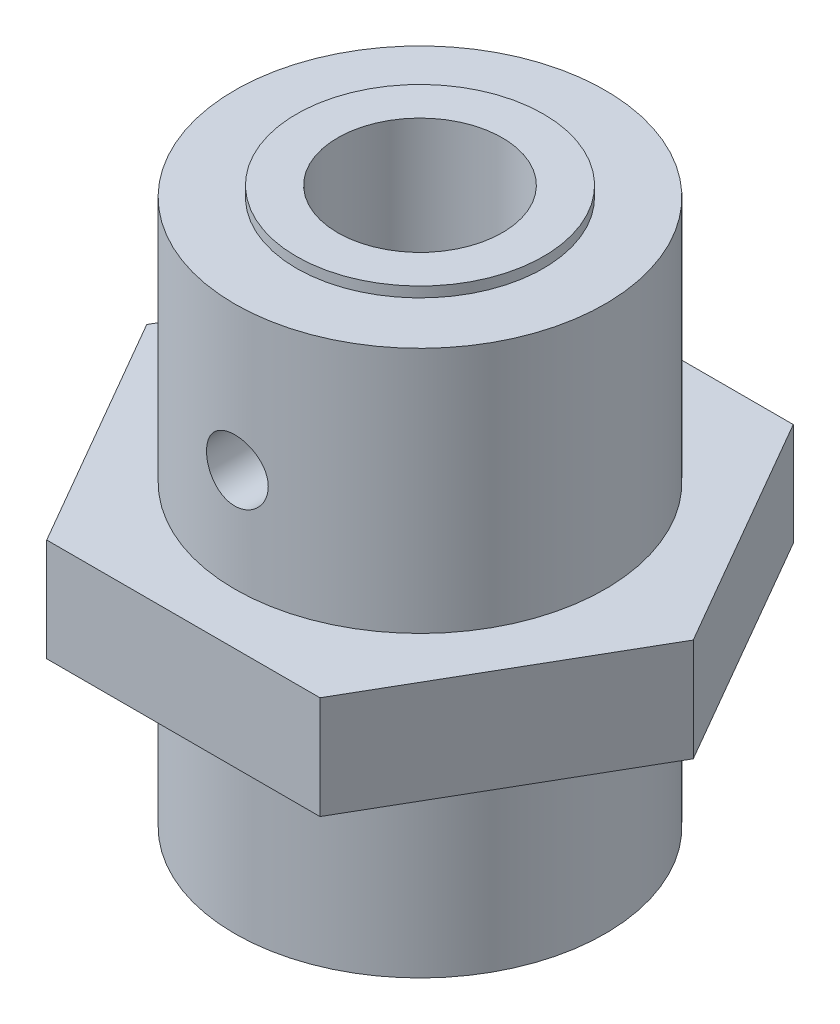
ISO-10303-21;
HEADER;
FILE_DESCRIPTION(('STEP AP214'),'2;1');
FILE_NAME('part.step','',(''),(''),'','','');
FILE_SCHEMA(('AUTOMOTIVE_DESIGN { 1 0 10303 214 1 1 1 1 }'));
ENDSEC;
DATA;
#1=APPLICATION_CONTEXT('core data for automotive mechanical design processes');
#2=APPLICATION_PROTOCOL_DEFINITION('international standard','automotive_design',2000,#1);
#3=PRODUCT_CONTEXT('',#1,'mechanical');
#4=PRODUCT('Part','Part','',(#3));
#5=PRODUCT_RELATED_PRODUCT_CATEGORY('part','',(#4));
#6=PRODUCT_DEFINITION_FORMATION('','',#4);
#7=PRODUCT_DEFINITION_CONTEXT('part definition',#1,'design');
#8=PRODUCT_DEFINITION('design','',#6,#7);
#9=PRODUCT_DEFINITION_SHAPE('','',#8);
#10=(LENGTH_UNIT() NAMED_UNIT(*) SI_UNIT(.MILLI.,.METRE.));
#11=(NAMED_UNIT(*) PLANE_ANGLE_UNIT() SI_UNIT($,.RADIAN.));
#12=(NAMED_UNIT(*) SI_UNIT($,.STERADIAN.) SOLID_ANGLE_UNIT());
#13=UNCERTAINTY_MEASURE_WITH_UNIT(LENGTH_MEASURE(1.E-05),#10,'distance_accuracy_value','');
#14=(GEOMETRIC_REPRESENTATION_CONTEXT(3) GLOBAL_UNCERTAINTY_ASSIGNED_CONTEXT((#13)) GLOBAL_UNIT_ASSIGNED_CONTEXT((#10,
#11,#12)) REPRESENTATION_CONTEXT('',''));
#15=CARTESIAN_POINT('',(0.,0.,0.));
#16=DIRECTION('',(0.,0.,1.));
#17=DIRECTION('',(1.,0.,0.));
#18=AXIS2_PLACEMENT_3D('',#15,#16,#17);
#19=CARTESIAN_POINT('',(0.,27.,0.));
#20=DIRECTION('',(0.,-1.,0.));
#21=DIRECTION('',(0.,0.,-1.));
#22=AXIS2_PLACEMENT_3D('',#19,#20,#21);
#23=CYLINDRICAL_SURFACE('',#22,9.);
#24=CARTESIAN_POINT('',(0.,0.,0.));
#25=DIRECTION('',(0.,1.,0.));
#26=DIRECTION('',(0.,0.,1.));
#27=AXIS2_PLACEMENT_3D('',#24,#25,#26);
#28=CIRCLE('',#27,9.);
#29=CARTESIAN_POINT('',(0.,0.,9.));
#30=VERTEX_POINT('',#29);
#31=EDGE_CURVE('E48',#30,#30,#28,.T.);
#32=ORIENTED_EDGE('',*,*,#31,.T.);
#33=EDGE_LOOP('',(#32));
#34=FACE_BOUND('',#33,.T.);
#35=CARTESIAN_POINT('',(0.,9.5,0.));
#36=DIRECTION('',(0.,1.,0.));
#37=DIRECTION('',(0.,0.,1.));
#38=AXIS2_PLACEMENT_3D('',#35,#36,#37);
#39=CIRCLE('',#38,9.);
#40=CARTESIAN_POINT('',(0.,9.5,9.));
#41=VERTEX_POINT('',#40);
#42=EDGE_CURVE('E11',#41,#41,#39,.T.);
#43=ORIENTED_EDGE('',*,*,#42,.F.);
#44=EDGE_LOOP('',(#43));
#45=FACE_BOUND('',#44,.T.);
#46=ADVANCED_FACE('F32',(#34,#45),#23,.T.);
#47=CARTESIAN_POINT('',(0.,27.,0.));
#48=DIRECTION('',(0.,1.,0.));
#49=DIRECTION('',(0.,0.,1.));
#50=AXIS2_PLACEMENT_3D('',#47,#48,#49);
#51=PLANE('',#50);
#52=CARTESIAN_POINT('',(0.,27.,0.));
#53=DIRECTION('',(0.,1.,0.));
#54=DIRECTION('',(0.,0.,1.));
#55=AXIS2_PLACEMENT_3D('',#52,#53,#54);
#56=CIRCLE('',#55,4.);
#57=CARTESIAN_POINT('',(0.,27.,4.));
#58=VERTEX_POINT('',#57);
#59=EDGE_CURVE('E350',#58,#58,#56,.T.);
#60=ORIENTED_EDGE('',*,*,#59,.F.);
#61=EDGE_LOOP('',(#60));
#62=FACE_BOUND('',#61,.T.);
#63=CARTESIAN_POINT('',(0.,27.,0.));
#64=DIRECTION('',(0.,1.,0.));
#65=DIRECTION('',(0.,0.,1.));
#66=AXIS2_PLACEMENT_3D('',#63,#64,#65);
#67=CIRCLE('',#66,6.);
#68=CARTESIAN_POINT('',(0.,27.,6.));
#69=VERTEX_POINT('',#68);
#70=EDGE_CURVE('E351',#69,#69,#67,.T.);
#71=ORIENTED_EDGE('',*,*,#70,.T.);
#72=EDGE_LOOP('',(#71));
#73=FACE_BOUND('',#72,.T.);
#74=ADVANCED_FACE('F193',(#62,#73),#51,.T.);
#75=CARTESIAN_POINT('',(0.,14.5,0.));
#76=DIRECTION('',(0.,1.,0.));
#77=DIRECTION('',(0.,0.,1.));
#78=AXIS2_PLACEMENT_3D('',#75,#76,#77);
#79=CIRCLE('',#78,9.);
#80=CARTESIAN_POINT('',(0.,14.5,9.));
#81=VERTEX_POINT('',#80);
#82=EDGE_CURVE('E146',#81,#81,#79,.T.);
#83=ORIENTED_EDGE('',*,*,#82,.T.);
#84=EDGE_LOOP('',(#83));
#85=FACE_BOUND('',#84,.T.);
#86=CARTESIAN_POINT('',(0.,21.,-9.));
#87=CARTESIAN_POINT('',(-0.0836345429749289,20.9999966466313,-8.99999856701294));
#88=CARTESIAN_POINT('',(-0.167314729103292,20.9929816350186,-8.9988220674782));
#89=CARTESIAN_POINT('',(-0.332328133003825,20.9651186047408,-8.99424206964832));
#90=CARTESIAN_POINT('',(-0.413659120775548,20.944257865853,-8.99083652354334));
#91=CARTESIAN_POINT('',(-0.571562848327586,20.8893507308443,-8.9821804094187));
#92=CARTESIAN_POINT('',(-0.64813942105914,20.8553151206157,-8.97693135095516));
#93=CARTESIAN_POINT('',(-0.794485105186766,20.7750526247686,-8.96516536249242));
#94=CARTESIAN_POINT('',(-0.864254993927155,20.7288271335102,-8.9586485775266));
#95=CARTESIAN_POINT('',(-0.995683568575008,20.6250269497077,-8.94499990474988));
#96=CARTESIAN_POINT('',(-1.05726774212098,20.5673585312183,-8.93786323088914));
#97=CARTESIAN_POINT('',(-1.16993309919596,20.4425112189163,-8.92381576126039));
#98=CARTESIAN_POINT('',(-1.22101361963458,20.375331725126,-8.91690497977601));
#99=CARTESIAN_POINT('',(-1.31152027536308,20.2328574202818,-8.90404539455869));
#100=CARTESIAN_POINT('',(-1.3508727317166,20.1575151979171,-8.89810277454982));
#101=CARTESIAN_POINT('',(-1.41633501924673,20.0011742614196,-8.88791873876805));
#102=CARTESIAN_POINT('',(-1.44244574493937,19.9201759297934,-8.88367720808584));
#103=CARTESIAN_POINT('',(-1.48044862667089,19.7556118350861,-8.87742322105653));
#104=CARTESIAN_POINT('',(-1.49246941748124,19.6720765580992,-8.8753906109142));
#105=CARTESIAN_POINT('',(-1.50235003517393,19.5041518338699,-8.8737236336199));
#106=CARTESIAN_POINT('',(-1.5002108642334,19.4197624474996,-8.87408909674329));
#107=CARTESIAN_POINT('',(-1.48193705903769,19.2534432832347,-8.87715857318133));
#108=CARTESIAN_POINT('',(-1.46594692913386,19.1714971178729,-8.8798384399135));
#109=CARTESIAN_POINT('',(-1.42065188424207,19.0114672093025,-8.88719697126605));
#110=CARTESIAN_POINT('',(-1.39134651259184,18.9333835986669,-8.89187570443963));
#111=CARTESIAN_POINT('',(-1.32010634765635,18.7828627059354,-8.9027308760046));
#112=CARTESIAN_POINT('',(-1.27811154832783,18.7104543563513,-8.90891440264395));
#113=CARTESIAN_POINT('',(-1.18272721053446,18.573657359677,-8.92207751049005));
#114=CARTESIAN_POINT('',(-1.12933675239257,18.509269360527,-8.92905715592572));
#115=CARTESIAN_POINT('',(-1.01188932729543,18.3895043485156,-8.94313216727871));
#116=CARTESIAN_POINT('',(-0.947708378323878,18.334248888876,-8.95022789538991));
#117=CARTESIAN_POINT('',(-0.810921149388988,18.2352733424008,-8.96365560838034));
#118=CARTESIAN_POINT('',(-0.738314815143853,18.1915533298901,-8.96998758833847));
#119=CARTESIAN_POINT('',(-0.586623549700025,18.1168786637182,-8.98118335735747));
#120=CARTESIAN_POINT('',(-0.507533235338796,18.0859347484012,-8.98604591044468));
#121=CARTESIAN_POINT('',(-0.345179007361639,18.0378034708524,-8.99374501807596));
#122=CARTESIAN_POINT('',(-0.261915443507681,18.0206149578158,-8.99658174210284));
#123=CARTESIAN_POINT('',(-0.0946259407809746,18.0006471849233,-8.99988677905612));
#124=CARTESIAN_POINT('',(-0.0106204422906071,17.9977010569166,-9.00038251807671));
#125=CARTESIAN_POINT('',(0.156683863733932,18.0058568066569,-8.99902484652702));
#126=CARTESIAN_POINT('',(0.239982698335223,18.0169581438802,-8.99717152634471));
#127=CARTESIAN_POINT('',(0.402993705328058,18.0527549096013,-8.99134096162921));
#128=CARTESIAN_POINT('',(0.482724521031228,18.0773677250341,-8.98737662880787));
#129=CARTESIAN_POINT('',(0.636928130916265,18.1394007109197,-8.97776678673215));
#130=CARTESIAN_POINT('',(0.711400629545831,18.1768216005812,-8.97212118307212));
#131=CARTESIAN_POINT('',(0.853698413681374,18.2637906748181,-8.95970709781445));
#132=CARTESIAN_POINT('',(0.921459150562287,18.3134430937003,-8.95292913532213));
#133=CARTESIAN_POINT('',(1.04774615130161,18.423322389231,-8.93903080435141));
#134=CARTESIAN_POINT('',(1.10627174381795,18.483550033966,-8.93191041102928));
#135=CARTESIAN_POINT('',(1.2130456677948,18.6136185288429,-8.91804105141507));
#136=CARTESIAN_POINT('',(1.26118125666823,18.6835524993086,-8.91129669682264));
#137=CARTESIAN_POINT('',(1.34502138617699,18.8306117814831,-8.89902917866731));
#138=CARTESIAN_POINT('',(1.38072632086189,18.9077368651365,-8.89350597639612));
#139=CARTESIAN_POINT('',(1.43852299888389,19.0666738396873,-8.88434072218623));
#140=CARTESIAN_POINT('',(1.46067085952877,19.1484648570183,-8.88069092586639));
#141=CARTESIAN_POINT('',(1.49090127226697,19.3146720775331,-8.87566630101156));
#142=CARTESIAN_POINT('',(1.4989850471677,19.3990880518392,-8.87429127469633));
#143=CARTESIAN_POINT('',(1.50082371962841,19.5670230995774,-8.87398039850407));
#144=CARTESIAN_POINT('',(1.49475608167511,19.6505402271452,-8.8750143390339));
#145=CARTESIAN_POINT('',(1.46884790337411,19.8153475488305,-8.87933868872237));
#146=CARTESIAN_POINT('',(1.44900740766749,19.8966377501651,-8.88262909056728));
#147=CARTESIAN_POINT('',(1.39618469375694,20.0546150623756,-8.89108413769032));
#148=CARTESIAN_POINT('',(1.36321775436027,20.1313074060336,-8.89624660331802));
#149=CARTESIAN_POINT('',(1.28509620234955,20.2781014015169,-8.90786621353324));
#150=CARTESIAN_POINT('',(1.23994098524914,20.3482027262233,-8.91432342233039));
#151=CARTESIAN_POINT('',(1.13809133062329,20.4807213498647,-8.92790072427373));
#152=CARTESIAN_POINT('',(1.08126633815619,20.5430376100202,-8.93502777345782));
#153=CARTESIAN_POINT('',(0.957965418828139,20.657310962685,-8.94908623416505));
#154=CARTESIAN_POINT('',(0.891487267747583,20.7092656611829,-8.95601760015928));
#155=CARTESIAN_POINT('',(0.75022150178417,20.80166896092,-8.96895917785332));
#156=CARTESIAN_POINT('',(0.675379672519693,20.8420356235878,-8.97496269751863));
#157=CARTESIAN_POINT('',(0.519907841627391,20.909561690766,-8.98530700561065));
#158=CARTESIAN_POINT('',(0.439283696898008,20.9367342486478,-8.98964944906489));
#159=CARTESIAN_POINT('',(0.298621986027242,20.971203164476,-8.99523474499773));
#160=CARTESIAN_POINT('',(0.239435298179069,20.9819846817696,-8.99701216364015));
#161=CARTESIAN_POINT('',(0.120173586191886,20.9963842427069,-8.99939529591673));
#162=CARTESIAN_POINT('',(0.0600985773650965,21.0000024096824,-9.00000102972385));
#163=CARTESIAN_POINT('',(0.,21.,-9.));
#164=B_SPLINE_CURVE_WITH_KNOTS('',3,(#86,#87,#88,#89,#90,#91,#92,#93,#94,#95,#96,#97,#98,#99,
#100,#101,#102,#103,#104,#105,#106,#107,#108,#109,#110,#111,#112,#113,#114,#115,#116,#117,#118,
#119,#120,#121,#122,#123,#124,#125,#126,#127,#128,#129,#130,#131,#132,#133,#134,#135,#136,#137,
#138,#139,#140,#141,#142,#143,#144,#145,#146,#147,#148,#149,#150,#151,#152,#153,#154,#155,#156,
#157,#158,#159,#160,#161,#162,#163),.UNSPECIFIED.,.T.,.F.,(4,2,2,2,2,2,2,2,2,2,2,2,2,2,2,2,2,2,
2,2,2,2,2,2,2,2,2,2,2,2,2,2,2,2,2,2,2,2,4),(0.,0.250683950963106,0.501598527417252,
0.752308120215161,1.00298904760487,1.25581494637399,1.50865680101914,1.76305512494304,
2.01743626125709,2.26947646262054,2.52149882592532,2.77092313056246,3.02035599015229,
3.27098733979535,3.52163892408344,3.77539661946796,4.02915594981509,4.28312813349542,
4.53707906712689,4.78804730094839,5.03900587821516,5.2884468420385,5.5379018149564,
5.78956095376214,6.0412383783257,6.29552293204572,6.54979942425566,6.80301613405064,
7.05621082671971,7.30624745713621,7.55628327712881,7.80602890935734,8.05578693017602,
8.30850830516036,8.56128800327384,8.8158133896432,9.07008451278043,9.25022548898411,
9.43036336366181),.UNSPECIFIED.);
#165=CARTESIAN_POINT('',(0.,21.,-9.));
#166=VERTEX_POINT('',#165);
#167=EDGE_CURVE('E161',#166,#166,#164,.T.);
#168=ORIENTED_EDGE('',*,*,#167,.T.);
#169=EDGE_LOOP('',(#168));
#170=FACE_BOUND('',#169,.T.);
#171=CARTESIAN_POINT('',(1.5,19.5,8.87411967464942));
#172=CARTESIAN_POINT('',(1.4999966390526,19.4163745511124,8.87412118440766));
#173=CARTESIAN_POINT('',(1.49298310142239,19.3327034363851,8.8753145552884));
#174=CARTESIAN_POINT('',(1.46512645684524,19.1677088740679,8.87995474420907));
#175=CARTESIAN_POINT('',(1.44427059618579,19.0863876637503,8.88340364034856));
#176=CARTESIAN_POINT('',(1.38937772620029,18.9285046299859,8.89215365593394));
#177=CARTESIAN_POINT('',(1.35535173295865,18.8519388908002,8.8974532270317));
#178=CARTESIAN_POINT('',(1.27511189813422,18.7056114271718,8.90930563268603));
#179=CARTESIAN_POINT('',(1.22889942810094,18.6358489382543,8.91585832618484));
#180=CARTESIAN_POINT('',(1.12511251617978,18.5044122901526,8.92955082691565));
#181=CARTESIAN_POINT('',(1.06744142935937,18.4428149211681,8.93669530396241));
#182=CARTESIAN_POINT('',(0.942583202817205,18.3301240158831,8.95072488401675));
#183=CARTESIAN_POINT('',(0.875395499489994,18.2790311021308,8.95760997163183));
#184=CARTESIAN_POINT('',(0.732913721969003,18.1885112596684,8.97039442189482));
#185=CARTESIAN_POINT('',(0.657573648874023,18.1491557953609,8.97628765459366));
#186=CARTESIAN_POINT('',(0.501237373034324,18.0836873576817,8.98637242174293));
#187=CARTESIAN_POINT('',(0.420241538446913,18.0575735232691,8.99056406683605));
#188=CARTESIAN_POINT('',(0.255686235806544,18.0195644790097,8.99674040834628));
#189=CARTESIAN_POINT('',(0.172157332007562,18.0075402503972,8.99874511866543));
#190=CARTESIAN_POINT('',(0.00424517131547819,17.9976505475084,9.00039047605669));
#191=CARTESIAN_POINT('',(-0.0801380271173394,17.9997841108517,9.00003128381585));
#192=CARTESIAN_POINT('',(-0.246481311047326,18.0180488109169,8.99700515058833));
#193=CARTESIAN_POINT('',(-0.328457118420085,18.0340410980455,8.99436110215438));
#194=CARTESIAN_POINT('',(-0.488545187767075,18.0793506445479,8.98708787262982));
#195=CARTESIAN_POINT('',(-0.566657331990903,18.1086683097537,8.98245863107927));
#196=CARTESIAN_POINT('',(-0.71721368866959,18.1799343841892,8.97169619107175));
#197=CARTESIAN_POINT('',(-0.789630313811427,18.2219400072495,8.96555620396128));
#198=CARTESIAN_POINT('',(-0.926439317907985,18.317347693581,8.95245442842898));
#199=CARTESIAN_POINT('',(-0.990831046749526,18.3707506792265,8.94549257351481));
#200=CARTESIAN_POINT('',(-1.110582764068,18.4882072839716,8.93142160939558));
#201=CARTESIAN_POINT('',(-1.16582370135193,18.5523822569406,8.92431173838625));
#202=CARTESIAN_POINT('',(-1.26477275306884,18.6891522541295,8.91082775870884));
#203=CARTESIAN_POINT('',(-1.30848076111945,18.7617473560097,8.90445365682795));
#204=CARTESIAN_POINT('',(-1.38314666069297,18.9134349851265,8.8931625273709));
#205=CARTESIAN_POINT('',(-1.41409021636755,18.9925346988553,8.88824713981561));
#206=CARTESIAN_POINT('',(-1.46221792248937,19.1549094433845,8.88045713213928));
#207=CARTESIAN_POINT('',(-1.47940328446077,19.2381841058595,8.87758233232993));
#208=CARTESIAN_POINT('',(-1.49935913092756,19.4054796936973,8.8742337565327));
#209=CARTESIAN_POINT('',(-1.50229932474746,19.4894798278213,8.87373171455201));
#210=CARTESIAN_POINT('',(-1.49413362160948,19.6567720030145,8.87511020869417));
#211=CARTESIAN_POINT('',(-1.4830282671748,19.7400640713084,8.87699065279112));
#212=CARTESIAN_POINT('',(-1.44723140095686,19.9030366555145,8.88289612473011));
#213=CARTESIAN_POINT('',(-1.42262627438783,19.9827366839268,8.88690751151009));
#214=CARTESIAN_POINT('',(-1.36061891411537,20.1368820997677,8.89661143803301));
#215=CARTESIAN_POINT('',(-1.32321591486056,20.2113271725305,8.90230407834347));
#216=CARTESIAN_POINT('',(-1.23627400393754,20.3536047566437,8.91479477038436));
#217=CARTESIAN_POINT('',(-1.18662633849562,20.4213699436536,8.92160253360208));
#218=CARTESIAN_POINT('',(-1.07675367942479,20.547668119617,8.9355280000792));
#219=CARTESIAN_POINT('',(-1.01652794183043,20.6062004586658,8.94264572511199));
#220=CARTESIAN_POINT('',(-0.886456842197286,20.7129911356372,8.95647853270959));
#221=CARTESIAN_POINT('',(-0.816517952031718,20.7611362957707,8.96318865806804));
#222=CARTESIAN_POINT('',(-0.669446068769596,20.8449931962029,8.97537067459765));
#223=CARTESIAN_POINT('',(-0.592313308482377,20.8807053386843,8.98084260581986));
#224=CARTESIAN_POINT('',(-0.433379430900797,20.9385063503729,8.9899101490175));
#225=CARTESIAN_POINT('',(-0.351600337561567,20.960654445441,8.99351390740573));
#226=CARTESIAN_POINT('',(-0.185418440924528,20.9908893593783,8.99847349901569));
#227=CARTESIAN_POINT('',(-0.101015854092975,20.9989773352394,8.99982951720106));
#228=CARTESIAN_POINT('',(0.0669247654642075,21.0008291293873,9.00013822732695));
#229=CARTESIAN_POINT('',(0.150460896361607,20.9947651523646,8.99911981214544));
#230=CARTESIAN_POINT('',(0.315307184588814,20.9688576466384,8.9948530703237));
#231=CARTESIAN_POINT('',(0.396617354380455,20.9490141950943,8.99160475617001));
#232=CARTESIAN_POINT('',(0.554637867551155,20.8961771006737,8.98324193296551));
#233=CARTESIAN_POINT('',(0.631353223292413,20.8631980990737,8.97812950224933));
#234=CARTESIAN_POINT('',(0.778188271789178,20.7850452382619,8.96659654126411));
#235=CARTESIAN_POINT('',(0.848307651670479,20.7398708009634,8.96017594898929));
#236=CARTESIAN_POINT('',(0.980827767316295,20.6379989445228,8.94664577771383));
#237=CARTESIAN_POINT('',(1.04313085836337,20.5811754271459,8.9395291473044));
#238=CARTESIAN_POINT('',(1.15737832556883,20.4578830152611,8.92545781982852));
#239=CARTESIAN_POINT('',(1.20932027202072,20.3914118646651,8.91850316108162));
#240=CARTESIAN_POINT('',(1.30170856255177,20.2501528064954,8.90549006142059));
#241=CARTESIAN_POINT('',(1.34207099345672,20.1753093960972,8.89943830788741));
#242=CARTESIAN_POINT('',(1.40958872186455,20.0198344584531,8.88899526133062));
#243=CARTESIAN_POINT('',(1.43675721313896,19.9392088063819,8.88460231050764));
#244=CARTESIAN_POINT('',(1.47121563187329,19.798557738314,8.87894846902668));
#245=CARTESIAN_POINT('',(1.48199245060217,19.7393839152249,8.8771477405261));
#246=CARTESIAN_POINT('',(1.49638577710945,19.6201479090953,8.87473281171912));
#247=CARTESIAN_POINT('',(1.50000241487516,19.5600857422019,8.87411858987266));
#248=CARTESIAN_POINT('',(1.5,19.5,8.87411967464942));
#249=B_SPLINE_CURVE_WITH_KNOTS('',3,(#171,#172,#173,#174,#175,#176,#177,#178,#179,#180,#181,
#182,#183,#184,#185,#186,#187,#188,#189,#190,#191,#192,#193,#194,#195,#196,#197,#198,#199,#200,
#201,#202,#203,#204,#205,#206,#207,#208,#209,#210,#211,#212,#213,#214,#215,#216,#217,#218,#219,
#220,#221,#222,#223,#224,#225,#226,#227,#228,#229,#230,#231,#232,#233,#234,#235,#236,#237,#238,
#239,#240,#241,#242,#243,#244,#245,#246,#247,#248),.UNSPECIFIED.,.T.,.F.,(4,2,2,2,2,2,2,2,2,2,2,
2,2,2,2,2,2,2,2,2,2,2,2,2,2,2,2,2,2,2,2,2,2,2,2,2,2,2,4),(0.,0.250656623343195,
0.501544511951669,0.752222998699,1.00287328440553,1.25573495490818,1.50861160698057,
1.7629978806425,2.01736761064057,2.26938940480928,2.52139406789004,2.7709027269619,
3.02041898547109,3.27107762481044,3.52175655733448,3.77547674074663,4.02919926445001,
4.28320597496552,4.53719031560235,4.78814125449636,5.03908250045775,5.28843638778684,
5.53780519373534,5.7894740565501,6.04116062655803,6.29546467818618,6.54976050283408,
6.80293790647977,7.05609447544799,7.30618665756939,7.55627743928683,7.80609023896863,
8.0559148823279,8.3086019847534,8.56134827326476,8.8158823656771,9.07016140042577,
9.25026402322163,9.43036337636995),.UNSPECIFIED.);
#250=CARTESIAN_POINT('',(1.5,19.5,8.87411967464942));
#251=VERTEX_POINT('',#250);
#252=EDGE_CURVE('E155',#251,#251,#249,.T.);
#253=ORIENTED_EDGE('',*,*,#252,.T.);
#254=EDGE_LOOP('',(#253));
#255=FACE_BOUND('',#254,.T.);
#256=CARTESIAN_POINT('',(0.,26.5,0.));
#257=DIRECTION('',(0.,1.,0.));
#258=DIRECTION('',(0.,0.,1.));
#259=AXIS2_PLACEMENT_3D('',#256,#257,#258);
#260=CIRCLE('',#259,9.);
#261=CARTESIAN_POINT('',(0.,26.5,9.));
#262=VERTEX_POINT('',#261);
#263=EDGE_CURVE('E345',#262,#262,#260,.T.);
#264=ORIENTED_EDGE('',*,*,#263,.F.);
#265=EDGE_LOOP('',(#264));
#266=FACE_BOUND('',#265,.T.);
#267=ADVANCED_FACE('F34',(#85,#170,#255,#266),#23,.T.);
#268=CARTESIAN_POINT('',(0.,0.,0.));
#269=DIRECTION('',(0.,1.,0.));
#270=DIRECTION('',(0.,0.,1.));
#271=AXIS2_PLACEMENT_3D('',#268,#269,#270);
#272=PLANE('',#271);
#273=ORIENTED_EDGE('',*,*,#31,.F.);
#274=EDGE_LOOP('',(#273));
#275=FACE_BOUND('',#274,.T.);
#276=CARTESIAN_POINT('',(0.,0.,0.));
#277=DIRECTION('',(0.,1.,0.));
#278=DIRECTION('',(0.,0.,1.));
#279=AXIS2_PLACEMENT_3D('',#276,#277,#278);
#280=CIRCLE('',#279,4.);
#281=CARTESIAN_POINT('',(0.,0.,4.));
#282=VERTEX_POINT('',#281);
#283=EDGE_CURVE('E347',#282,#282,#280,.T.);
#284=ORIENTED_EDGE('',*,*,#283,.T.);
#285=EDGE_LOOP('',(#284));
#286=FACE_BOUND('',#285,.T.);
#287=ADVANCED_FACE('F191',(#275,#286),#272,.F.);
#288=CARTESIAN_POINT('',(0.,27.,0.));
#289=DIRECTION('',(0.,-1.,0.));
#290=DIRECTION('',(0.,0.,-1.));
#291=AXIS2_PLACEMENT_3D('',#288,#289,#290);
#292=CYLINDRICAL_SURFACE('',#291,4.);
#293=CARTESIAN_POINT('',(0.,21.,-4.));
#294=CARTESIAN_POINT('',(-0.0812350589378528,21.0000029023031,-4.00000217456151));
#295=CARTESIAN_POINT('',(-0.162450241781792,20.9933802397516,-3.99750379283184));
#296=CARTESIAN_POINT('',(-0.322453452352361,20.9671718047301,-3.98778696006928));
#297=CARTESIAN_POINT('',(-0.401241827987616,20.9475878995294,-3.98056918893993));
#298=CARTESIAN_POINT('',(-0.554060784990878,20.8962469982282,-3.96218832391545));
#299=CARTESIAN_POINT('',(-0.628100224162277,20.8645134831782,-3.9510328434944));
#300=CARTESIAN_POINT('',(-0.769799310160253,20.7898935869842,-3.92588767765353));
#301=CARTESIAN_POINT('',(-0.837457239177879,20.7470042144558,-3.91189723227548));
#302=CARTESIAN_POINT('',(-0.967346417045826,20.6493874689291,-3.88186246971217));
#303=CARTESIAN_POINT('',(-1.02927073015119,20.5942697377406,-3.86576002583566));
#304=CARTESIAN_POINT('',(-1.14324421474363,20.4745895653412,-3.83360220871327));
#305=CARTESIAN_POINT('',(-1.19529036359203,20.4100242439121,-3.81754685135033));
#306=CARTESIAN_POINT('',(-1.28998202215985,20.2702825324768,-3.78662470617731));
#307=CARTESIAN_POINT('',(-1.3321939319576,20.1947956334542,-3.77182648820818));
#308=CARTESIAN_POINT('',(-1.40318646334084,20.0371516458315,-3.74599860237433));
#309=CARTESIAN_POINT('',(-1.43197244961239,19.9549972368449,-3.73496742975881));
#310=CARTESIAN_POINT('',(-1.47408431017549,19.7898832597418,-3.71854412824136));
#311=CARTESIAN_POINT('',(-1.48799593218558,19.7070949615646,-3.71293924350838));
#312=CARTESIAN_POINT('',(-1.50179556531648,19.5401838420062,-3.70738061461215));
#313=CARTESIAN_POINT('',(-1.50168936802631,19.4560615861255,-3.70742453659305));
#314=CARTESIAN_POINT('',(-1.48790429610018,19.294230474787,-3.71297511632055));
#315=CARTESIAN_POINT('',(-1.47503808509003,19.2164390939558,-3.71815468871121));
#316=CARTESIAN_POINT('',(-1.4374416786833,19.0642128495947,-3.73284938059529));
#317=CARTESIAN_POINT('',(-1.41270969663258,18.9897784933861,-3.74236515298863));
#318=CARTESIAN_POINT('',(-1.35163748571904,18.8447229322718,-3.76485702190253));
#319=CARTESIAN_POINT('',(-1.31508648737101,18.7742005138787,-3.77789517988166));
#320=CARTESIAN_POINT('',(-1.23156073762698,18.640054262409,-3.80594210139319));
#321=CARTESIAN_POINT('',(-1.18458238728897,18.5764328224803,-3.82095154457158));
#322=CARTESIAN_POINT('',(-1.07781780766549,18.4533963363491,-3.85248038859113));
#323=CARTESIAN_POINT('',(-1.01738298716956,18.3945513592519,-3.86903347455671));
#324=CARTESIAN_POINT('',(-0.887312590819022,18.2876620337942,-3.90091728164085));
#325=CARTESIAN_POINT('',(-0.817675603497365,18.2396193453943,-3.91624781465952));
#326=CARTESIAN_POINT('',(-0.66972343699242,18.1550696029375,-3.9442639480908));
#327=CARTESIAN_POINT('',(-0.59129071384472,18.1187524187789,-3.95690498259616));
#328=CARTESIAN_POINT('',(-0.428836850524585,18.06001739573,-3.97778718326962));
#329=CARTESIAN_POINT('',(-0.344818210845769,18.0375933834389,-3.98603030341493));
#330=CARTESIAN_POINT('',(-0.178375243148667,18.0083772124581,-3.99684443228065));
#331=CARTESIAN_POINT('',(-0.0961036195622112,18.0008173936175,-3.99969369025686));
#332=CARTESIAN_POINT('',(0.0685724752550229,17.9993089361001,-4.00025893700126));
#333=CARTESIAN_POINT('',(0.150976912983371,18.0053572796832,-3.99797606386863));
#334=CARTESIAN_POINT('',(0.310262048561858,18.0303100423087,-3.98871709772643));
#335=CARTESIAN_POINT('',(0.387233328007334,18.0487115437371,-3.98192470962305));
#336=CARTESIAN_POINT('',(0.536941754957219,18.0971860725473,-3.96451477091717));
#337=CARTESIAN_POINT('',(0.609678350347533,18.127260617948,-3.9538967228203));
#338=CARTESIAN_POINT('',(0.751247765110155,18.1991864124395,-3.92949624407682));
#339=CARTESIAN_POINT('',(0.819903083557795,18.2413577292234,-3.91563000209348));
#340=CARTESIAN_POINT('',(0.949392711726626,18.3359181031716,-3.88626671564664));
#341=CARTESIAN_POINT('',(1.01022412027045,18.3883109325451,-3.87076907009516));
#342=CARTESIAN_POINT('',(1.12603079874454,18.5054041221243,-3.8387332949099));
#343=CARTESIAN_POINT('',(1.18046154123568,18.5706421827727,-3.82218696503729));
#344=CARTESIAN_POINT('',(1.27771050031903,18.7096513847077,-3.79078815746854));
#345=CARTESIAN_POINT('',(1.32052767414518,18.7834232913885,-3.77593583194399));
#346=CARTESIAN_POINT('',(1.39337773518998,18.9380159867723,-3.74966829822463));
#347=CARTESIAN_POINT('',(1.42335685446918,19.0188647459104,-3.73826760328493));
#348=CARTESIAN_POINT('',(1.46907883466889,19.1850097636878,-3.72054032891005));
#349=CARTESIAN_POINT('',(1.48483050305535,19.2703032361981,-3.71421061057491));
#350=CARTESIAN_POINT('',(1.50086347097839,19.4370161595411,-3.70775894792573));
#351=CARTESIAN_POINT('',(1.50207331495837,19.5183326317169,-3.70726444523341));
#352=CARTESIAN_POINT('',(1.49136715641593,19.6799453162762,-3.71158412745292));
#353=CARTESIAN_POINT('',(1.47945239850124,19.7602416246716,-3.71639780898899));
#354=CARTESIAN_POINT('',(1.44355815630242,19.9150472267165,-3.73048141585432));
#355=CARTESIAN_POINT('',(1.41995798316524,19.9896583462453,-3.73961085376663));
#356=CARTESIAN_POINT('',(1.3616969677992,20.1339055084944,-3.76121548297845));
#357=CARTESIAN_POINT('',(1.32703332944945,20.2035402880701,-3.77369151995215));
#358=CARTESIAN_POINT('',(1.24552075938154,20.3398267896976,-3.80139723903965));
#359=CARTESIAN_POINT('',(1.1981283280301,20.4061307967999,-3.81673698440964));
#360=CARTESIAN_POINT('',(1.09334485729906,20.5301415609712,-3.84806246757177));
#361=CARTESIAN_POINT('',(1.03595064012808,20.5878455747868,-3.86404840943145));
#362=CARTESIAN_POINT('',(0.909080396784623,20.6962019558218,-3.89590424609881));
#363=CARTESIAN_POINT('',(0.839118644212992,20.7463037534347,-3.91172104900645));
#364=CARTESIAN_POINT('',(0.691213223200821,20.8340226552766,-3.94054514457031));
#365=CARTESIAN_POINT('',(0.613268934090622,20.8716387877364,-3.95355221851559));
#366=CARTESIAN_POINT('',(0.447999082002314,20.9343768290483,-3.9757429260668));
#367=CARTESIAN_POINT('',(0.36041342223421,20.9588870646019,-3.98473657158356));
#368=CARTESIAN_POINT('',(0.181875733606383,20.9916929599207,-3.99686242179587));
#369=CARTESIAN_POINT('',(0.0909254163648595,20.9999967514873,-3.99999756603967));
#370=CARTESIAN_POINT('',(0.,21.,-4.));
#371=B_SPLINE_CURVE_WITH_KNOTS('',3,(#293,#294,#295,#296,#297,#298,#299,#300,#301,#302,#303,
#304,#305,#306,#307,#308,#309,#310,#311,#312,#313,#314,#315,#316,#317,#318,#319,#320,#321,#322,
#323,#324,#325,#326,#327,#328,#329,#330,#331,#332,#333,#334,#335,#336,#337,#338,#339,#340,#341,
#342,#343,#344,#345,#346,#347,#348,#349,#350,#351,#352,#353,#354,#355,#356,#357,#358,#359,#360,
#361,#362,#363,#364,#365,#366,#367,#368,#369,#370),.UNSPECIFIED.,.T.,.F.,(4,2,2,2,2,2,2,2,2,2,2,
2,2,2,2,2,2,2,2,2,2,2,2,2,2,2,2,2,2,2,2,2,2,2,2,2,2,2,4),(0.,0.24336980156056,0.48670454953046,
0.729571369213572,0.972503379609489,1.22473618582715,1.47704604925622,1.73896674501658,
2.00078269352134,2.25185874416901,2.50283106079707,2.73878345119972,2.97477138060589,
3.21522408387018,3.45575990744259,3.71246153335813,3.96920257905066,4.22991375286075,
4.49050899698846,4.73725019635926,4.98393668390521,5.2211443792384,5.45838293254454,
5.702592218596,5.94689180019868,6.20536519455658,6.46386178920141,6.72343066727204,
6.98283874956507,7.22558763480252,7.46831350211259,7.70363142426534,7.93900886656507,
8.18672471884271,8.43451941997062,8.69572329654039,8.95694749805102,9.22948515032042,
9.50188601796128),.UNSPECIFIED.);
#372=CARTESIAN_POINT('',(0.,21.,-4.));
#373=VERTEX_POINT('',#372);
#374=EDGE_CURVE('E37',#373,#373,#371,.T.);
#375=ORIENTED_EDGE('',*,*,#374,.F.);
#376=EDGE_LOOP('',(#375));
#377=FACE_BOUND('',#376,.T.);
#378=CARTESIAN_POINT('',(1.5,19.5,3.70809924354783));
#379=CARTESIAN_POINT('',(1.50000304106109,19.4189925162792,3.70809640633806));
#380=CARTESIAN_POINT('',(1.49341597549487,19.3380050774964,3.71078260240986));
#381=CARTESIAN_POINT('',(1.46736187895468,19.1784719170868,3.72116159304967));
#382=CARTESIAN_POINT('',(1.44789523373263,19.099926122405,3.72885423767112));
#383=CARTESIAN_POINT('',(1.39689657610574,18.9476246283865,3.748254802809));
#384=CARTESIAN_POINT('',(1.36539347266348,18.8738579433489,3.7599530956926));
#385=CARTESIAN_POINT('',(1.29131856742698,18.7326281031812,3.78603134206598));
#386=CARTESIAN_POINT('',(1.24874344095039,18.6651668497175,3.80041210067323));
#387=CARTESIAN_POINT('',(1.15146661374162,18.5351096883772,3.83103574665713));
#388=CARTESIAN_POINT('',(1.09630381213306,18.4728714703706,3.84733341923603));
#389=CARTESIAN_POINT('',(0.976395839778928,18.3582771853285,3.87949750628547));
#390=CARTESIAN_POINT('',(0.91164863025668,18.3059232262581,3.89536382814785));
#391=CARTESIAN_POINT('',(0.7716946551776,18.2108604877044,3.92552873936553));
#392=CARTESIAN_POINT('',(0.696206947538028,18.1685405252841,3.93975561223505));
#393=CARTESIAN_POINT('',(0.538555771965249,18.0973488274751,3.96438007973848));
#394=CARTESIAN_POINT('',(0.456394630933537,18.068472428008,3.97477900217006));
#395=CARTESIAN_POINT('',(0.291489341676833,18.0262421042254,3.9901869710344));
#396=CARTESIAN_POINT('',(0.208923197281597,18.0122723725595,3.99540915214774));
#397=CARTESIAN_POINT('',(0.0424643637947862,17.998278799055,4.0006401410794));
#398=CARTESIAN_POINT('',(-0.041427885062833,17.9982504223813,4.00065064414902));
#399=CARTESIAN_POINT('',(-0.203743543064476,18.0117817614652,3.99559265903894));
#400=CARTESIAN_POINT('',(-0.2822321782669,18.0246692979488,3.99077541996683));
#401=CARTESIAN_POINT('',(-0.435839217984391,18.0625359152256,3.97693274932263));
#402=CARTESIAN_POINT('',(-0.510957383430298,18.087515852262,3.96790701975577));
#403=CARTESIAN_POINT('',(-0.656989017303104,18.1491704516758,3.9463776916753));
#404=CARTESIAN_POINT('',(-0.72782539228731,18.1860100052684,3.93382539470077));
#405=CARTESIAN_POINT('',(-0.86248660795756,18.2701920969294,3.90651310225279));
#406=CARTESIAN_POINT('',(-0.926309176932323,18.3175380230176,3.8917523951284));
#407=CARTESIAN_POINT('',(-1.04909048680094,18.4246272862832,3.86052529655816));
#408=CARTESIAN_POINT('',(-1.10754614526348,18.4849339156504,3.84400963763883));
#409=CARTESIAN_POINT('',(-1.21370395569342,18.6145929933216,3.81182460645722));
#410=CARTESIAN_POINT('',(-1.261403406929,18.6839477065866,3.79615544748847));
#411=CARTESIAN_POINT('',(-1.34565611808152,18.8317194674628,3.76712703500335));
#412=CARTESIAN_POINT('',(-1.38193847851831,18.9103034936861,3.75382677150277));
#413=CARTESIAN_POINT('',(-1.44056464441501,19.0730962251676,3.73172438629002));
#414=CARTESIAN_POINT('',(-1.46291620605595,19.1573017715937,3.72291976205783));
#415=CARTESIAN_POINT('',(-1.49190191709668,19.323975962316,3.71139597222848));
#416=CARTESIAN_POINT('',(-1.49933521158966,19.4062841055361,3.70836785241537));
#417=CARTESIAN_POINT('',(-1.50057885636272,19.5710093567417,3.70786539525016));
#418=CARTESIAN_POINT('',(-1.49439261093762,19.6534264323525,3.71038967003987));
#419=CARTESIAN_POINT('',(-1.46929733520157,19.8119299222877,3.72039381629735));
#420=CARTESIAN_POINT('',(-1.45100618334225,19.8881311357647,3.72763276216449));
#421=CARTESIAN_POINT('',(-1.40299774640638,20.0363479447202,3.74596487046361));
#422=CARTESIAN_POINT('',(-1.37327812034623,20.1083626791681,3.75705882250172));
#423=CARTESIAN_POINT('',(-1.30200292275278,20.2491644380762,3.7823624311608));
#424=CARTESIAN_POINT('',(-1.26004545177047,20.3177292921373,3.79667328892065));
#425=CARTESIAN_POINT('',(-1.16591317862479,20.447128981726,3.82662814294291));
#426=CARTESIAN_POINT('',(-1.11373463696435,20.5079609746246,3.84227262594077));
#427=CARTESIAN_POINT('',(-0.996727340900938,20.6241683731951,3.87433046553184));
#428=CARTESIAN_POINT('',(-0.931306341491062,20.6789534087688,3.89072969357028));
#429=CARTESIAN_POINT('',(-0.791797471753152,20.7768383675894,3.92149874963302));
#430=CARTESIAN_POINT('',(-0.717709573322675,20.8199382529458,3.93586857107664));
#431=CARTESIAN_POINT('',(-0.56301632946848,20.8929460561996,3.96094985704552));
#432=CARTESIAN_POINT('',(-0.482434433064629,20.9228991237926,3.9716738133801));
#433=CARTESIAN_POINT('',(-0.316881887523257,20.9686564138499,3.98829436712571));
#434=CARTESIAN_POINT('',(-0.231913320723595,20.9844672854224,3.99419323299412));
#435=CARTESIAN_POINT('',(-0.0653355852738167,21.0007744027548,4.00028407317073));
#436=CARTESIAN_POINT('',(0.0161807680608443,21.002109483059,4.00078860953764));
#437=CARTESIAN_POINT('',(0.178226786412423,20.9915848405546,3.99684889809224));
#438=CARTESIAN_POINT('',(0.258756569245256,20.9797267091141,3.9924052471313));
#439=CARTESIAN_POINT('',(0.414548248377125,20.9437411485064,3.97921089603771));
#440=CARTESIAN_POINT('',(0.489890731068834,20.9199200941216,3.97056791378017));
#441=CARTESIAN_POINT('',(0.635515473006389,20.8609899866156,3.9498778362099));
#442=CARTESIAN_POINT('',(0.705796771275542,20.8258787966952,3.93783009655664));
#443=CARTESIAN_POINT('',(0.842540176994412,20.7436860564952,3.91090618300074));
#444=CARTESIAN_POINT('',(0.908717548846849,20.6961633594859,3.89593240108828));
#445=CARTESIAN_POINT('',(1.03241734752336,20.5911921698124,3.86499507694844));
#446=CARTESIAN_POINT('',(1.0899366712559,20.5337401341921,3.84903118274027));
#447=CARTESIAN_POINT('',(1.19781214236196,20.4069358683549,3.81688129739175));
#448=CARTESIAN_POINT('',(1.24762999816025,20.3371155978457,3.8007280534916));
#449=CARTESIAN_POINT('',(1.33484709556843,20.1895841304267,3.77098325003638));
#450=CARTESIAN_POINT('',(1.37224504878157,20.1118721159465,3.75739195631216));
#451=CARTESIAN_POINT('',(1.4346588697426,19.9470443190246,3.73402269853266));
#452=CARTESIAN_POINT('',(1.45906002899523,19.8596656334882,3.7244380329086));
#453=CARTESIAN_POINT('',(1.49172356722079,19.6815147280442,3.71147994336315));
#454=CARTESIAN_POINT('',(1.49999659339571,19.59074478729,3.70810242179736));
#455=CARTESIAN_POINT('',(1.5,19.5,3.70809924354783));
#456=B_SPLINE_CURVE_WITH_KNOTS('',3,(#378,#379,#380,#381,#382,#383,#384,#385,#386,#387,#388,
#389,#390,#391,#392,#393,#394,#395,#396,#397,#398,#399,#400,#401,#402,#403,#404,#405,#406,#407,
#408,#409,#410,#411,#412,#413,#414,#415,#416,#417,#418,#419,#420,#421,#422,#423,#424,#425,#426,
#427,#428,#429,#430,#431,#432,#433,#434,#435,#436,#437,#438,#439,#440,#441,#442,#443,#444,#445,
#446,#447,#448,#449,#450,#451,#452,#453,#454,#455),.UNSPECIFIED.,.T.,.F.,(4,2,2,2,2,2,2,2,2,2,2,
2,2,2,2,2,2,2,2,2,2,2,2,2,2,2,2,2,2,2,2,2,2,2,2,2,2,2,4),(0.,0.242684541416171,
0.485361814598854,0.727459856757029,0.969630679682935,1.22274652401128,1.47591628822983,
1.73770072136421,1.9993942638133,2.24980018489679,2.50012465404857,2.73806472803194,
2.97602165263335,3.21744131210668,3.45893893628976,3.71456675065875,3.97025867827335,
4.23162592252966,4.49284751635474,4.73965657740485,4.98640395388884,5.22143845928198,
5.45652113429527,5.70041561005822,5.94439948466356,6.20385016993624,6.46330169650178,
6.72185508890168,6.98028685560127,7.22365720549936,7.4669982031948,7.70440274003891,
7.94185223512831,8.18928323676987,8.43680270894965,8.6973859954208,8.95799630544243,
9.23003178870927,9.50188762323054),.UNSPECIFIED.);
#457=CARTESIAN_POINT('',(1.5,19.5,3.70809924354783));
#458=VERTEX_POINT('',#457);
#459=EDGE_CURVE('E153',#458,#458,#456,.T.);
#460=ORIENTED_EDGE('',*,*,#459,.F.);
#461=EDGE_LOOP('',(#460));
#462=FACE_BOUND('',#461,.T.);
#463=ORIENTED_EDGE('',*,*,#59,.T.);
#464=EDGE_LOOP('',(#463));
#465=FACE_BOUND('',#464,.T.);
#466=ORIENTED_EDGE('',*,*,#283,.F.);
#467=EDGE_LOOP('',(#466));
#468=FACE_BOUND('',#467,.T.);
#469=ADVANCED_FACE('F186',(#377,#462,#465,#468),#292,.F.);
#470=CARTESIAN_POINT('',(0.,26.5,0.));
#471=DIRECTION('',(0.,1.,0.));
#472=DIRECTION('',(0.,0.,1.));
#473=AXIS2_PLACEMENT_3D('',#470,#471,#472);
#474=PLANE('',#473);
#475=CARTESIAN_POINT('',(0.,26.5,0.));
#476=DIRECTION('',(0.,1.,0.));
#477=DIRECTION('',(0.,0.,1.));
#478=AXIS2_PLACEMENT_3D('',#475,#476,#477);
#479=CIRCLE('',#478,6.);
#480=CARTESIAN_POINT('',(0.,26.5,6.));
#481=VERTEX_POINT('',#480);
#482=EDGE_CURVE('E342',#481,#481,#479,.T.);
#483=ORIENTED_EDGE('',*,*,#482,.F.);
#484=EDGE_LOOP('',(#483));
#485=FACE_BOUND('',#484,.T.);
#486=ORIENTED_EDGE('',*,*,#263,.T.);
#487=EDGE_LOOP('',(#486));
#488=FACE_BOUND('',#487,.T.);
#489=ADVANCED_FACE('F190',(#485,#488),#474,.T.);
#490=CARTESIAN_POINT('',(0.,26.5,0.));
#491=DIRECTION('',(0.,1.,0.));
#492=DIRECTION('',(0.,0.,1.));
#493=AXIS2_PLACEMENT_3D('',#490,#491,#492);
#494=CYLINDRICAL_SURFACE('',#493,6.);
#495=ORIENTED_EDGE('',*,*,#482,.T.);
#496=EDGE_LOOP('',(#495));
#497=FACE_BOUND('',#496,.T.);
#498=ORIENTED_EDGE('',*,*,#70,.F.);
#499=EDGE_LOOP('',(#498));
#500=FACE_BOUND('',#499,.T.);
#501=ADVANCED_FACE('F175',(#497,#500),#494,.T.);
#502=CARTESIAN_POINT('',(0.,19.5,-9.));
#503=DIRECTION('',(0.,0.,1.));
#504=DIRECTION('',(1.,0.,0.));
#505=AXIS2_PLACEMENT_3D('',#502,#503,#504);
#506=CYLINDRICAL_SURFACE('',#505,1.5);
#507=ORIENTED_EDGE('',*,*,#459,.T.);
#508=EDGE_LOOP('',(#507));
#509=FACE_BOUND('',#508,.T.);
#510=ORIENTED_EDGE('',*,*,#252,.F.);
#511=EDGE_LOOP('',(#510));
#512=FACE_BOUND('',#511,.T.);
#513=ADVANCED_FACE('F171',(#509,#512),#506,.F.);
#514=ORIENTED_EDGE('',*,*,#374,.T.);
#515=EDGE_LOOP('',(#514));
#516=FACE_BOUND('',#515,.T.);
#517=ORIENTED_EDGE('',*,*,#167,.F.);
#518=EDGE_LOOP('',(#517));
#519=FACE_BOUND('',#518,.T.);
#520=ADVANCED_FACE('F166',(#516,#519),#506,.F.);
#521=CARTESIAN_POINT('',(0.,9.5,0.));
#522=DIRECTION('',(0.,1.,0.));
#523=DIRECTION('',(0.,0.,1.));
#524=AXIS2_PLACEMENT_3D('',#521,#522,#523);
#525=PLANE('',#524);
#526=DIRECTION('',(0.5,0.,-0.866025403784439));
#527=VECTOR('',#526,1.);
#528=CARTESIAN_POINT('',(6.6395280956807,9.5,11.5));
#529=LINE('',#528,#527);
#530=CARTESIAN_POINT('',(6.6395280956807,9.5,11.5));
#531=VERTEX_POINT('',#530);
#532=CARTESIAN_POINT('',(13.2790561913614,9.5,0.));
#533=VERTEX_POINT('',#532);
#534=EDGE_CURVE('E144',#531,#533,#529,.T.);
#535=ORIENTED_EDGE('',*,*,#534,.F.);
#536=DIRECTION('',(1.,0.,0.));
#537=VECTOR('',#536,1.);
#538=CARTESIAN_POINT('',(-6.63952809568069,9.5,11.5));
#539=LINE('',#538,#537);
#540=CARTESIAN_POINT('',(-6.63952809568069,9.5,11.5));
#541=VERTEX_POINT('',#540);
#542=EDGE_CURVE('E119',#541,#531,#539,.T.);
#543=ORIENTED_EDGE('',*,*,#542,.F.);
#544=DIRECTION('',(0.5,0.,0.866025403784438));
#545=VECTOR('',#544,1.);
#546=CARTESIAN_POINT('',(-13.2790561913614,9.5,0.));
#547=LINE('',#546,#545);
#548=CARTESIAN_POINT('',(-13.2790561913614,9.5,0.));
#549=VERTEX_POINT('',#548);
#550=EDGE_CURVE('E103',#549,#541,#547,.T.);
#551=ORIENTED_EDGE('',*,*,#550,.F.);
#552=DIRECTION('',(-0.5,0.,0.866025403784439));
#553=VECTOR('',#552,1.);
#554=CARTESIAN_POINT('',(-6.6395280956807,9.5,-11.5));
#555=LINE('',#554,#553);
#556=CARTESIAN_POINT('',(-6.6395280956807,9.5,-11.5));
#557=VERTEX_POINT('',#556);
#558=EDGE_CURVE('E117',#557,#549,#555,.T.);
#559=ORIENTED_EDGE('',*,*,#558,.F.);
#560=DIRECTION('',(-1.,0.,0.));
#561=VECTOR('',#560,1.);
#562=CARTESIAN_POINT('',(6.63952809568069,9.5,-11.5));
#563=LINE('',#562,#561);
#564=CARTESIAN_POINT('',(6.63952809568069,9.5,-11.5));
#565=VERTEX_POINT('',#564);
#566=EDGE_CURVE('E122',#565,#557,#563,.T.);
#567=ORIENTED_EDGE('',*,*,#566,.F.);
#568=DIRECTION('',(-0.5,0.,-0.866025403784438));
#569=VECTOR('',#568,1.);
#570=CARTESIAN_POINT('',(13.2790561913614,9.5,0.));
#571=LINE('',#570,#569);
#572=EDGE_CURVE('E124',#533,#565,#571,.T.);
#573=ORIENTED_EDGE('',*,*,#572,.F.);
#574=EDGE_LOOP('',(#535,#543,#551,#559,#567,#573));
#575=FACE_BOUND('',#574,.T.);
#576=ORIENTED_EDGE('',*,*,#42,.T.);
#577=EDGE_LOOP('',(#576));
#578=FACE_BOUND('',#577,.T.);
#579=ADVANCED_FACE('F114',(#575,#578),#525,.F.);
#580=CARTESIAN_POINT('',(0.,14.5,0.));
#581=DIRECTION('',(0.,1.,0.));
#582=DIRECTION('',(0.,0.,1.));
#583=AXIS2_PLACEMENT_3D('',#580,#581,#582);
#584=PLANE('',#583);
#585=DIRECTION('',(0.5,0.,-0.866025403784439));
#586=VECTOR('',#585,1.);
#587=CARTESIAN_POINT('',(6.6395280956807,14.5,11.5));
#588=LINE('',#587,#586);
#589=CARTESIAN_POINT('',(6.6395280956807,14.5,11.5));
#590=VERTEX_POINT('',#589);
#591=CARTESIAN_POINT('',(13.2790561913614,14.5,0.));
#592=VERTEX_POINT('',#591);
#593=EDGE_CURVE('E129',#590,#592,#588,.T.);
#594=ORIENTED_EDGE('',*,*,#593,.T.);
#595=DIRECTION('',(-0.5,0.,-0.866025403784438));
#596=VECTOR('',#595,1.);
#597=CARTESIAN_POINT('',(13.2790561913614,14.5,0.));
#598=LINE('',#597,#596);
#599=CARTESIAN_POINT('',(6.63952809568069,14.5,-11.5));
#600=VERTEX_POINT('',#599);
#601=EDGE_CURVE('E132',#592,#600,#598,.T.);
#602=ORIENTED_EDGE('',*,*,#601,.T.);
#603=DIRECTION('',(-1.,0.,0.));
#604=VECTOR('',#603,1.);
#605=CARTESIAN_POINT('',(6.63952809568069,14.5,-11.5));
#606=LINE('',#605,#604);
#607=CARTESIAN_POINT('',(-6.6395280956807,14.5,-11.5));
#608=VERTEX_POINT('',#607);
#609=EDGE_CURVE('E135',#600,#608,#606,.T.);
#610=ORIENTED_EDGE('',*,*,#609,.T.);
#611=DIRECTION('',(-0.5,0.,0.866025403784439));
#612=VECTOR('',#611,1.);
#613=CARTESIAN_POINT('',(-6.6395280956807,14.5,-11.5));
#614=LINE('',#613,#612);
#615=CARTESIAN_POINT('',(-13.2790561913614,14.5,0.));
#616=VERTEX_POINT('',#615);
#617=EDGE_CURVE('E138',#608,#616,#614,.T.);
#618=ORIENTED_EDGE('',*,*,#617,.T.);
#619=DIRECTION('',(0.5,0.,0.866025403784438));
#620=VECTOR('',#619,1.);
#621=CARTESIAN_POINT('',(-13.2790561913614,14.5,0.));
#622=LINE('',#621,#620);
#623=CARTESIAN_POINT('',(-6.63952809568069,14.5,11.5));
#624=VERTEX_POINT('',#623);
#625=EDGE_CURVE('E105',#616,#624,#622,.T.);
#626=ORIENTED_EDGE('',*,*,#625,.T.);
#627=DIRECTION('',(1.,0.,0.));
#628=VECTOR('',#627,1.);
#629=CARTESIAN_POINT('',(-6.63952809568069,14.5,11.5));
#630=LINE('',#629,#628);
#631=EDGE_CURVE('E141',#624,#590,#630,.T.);
#632=ORIENTED_EDGE('',*,*,#631,.T.);
#633=EDGE_LOOP('',(#594,#602,#610,#618,#626,#632));
#634=FACE_BOUND('',#633,.T.);
#635=ORIENTED_EDGE('',*,*,#82,.F.);
#636=EDGE_LOOP('',(#635));
#637=FACE_BOUND('',#636,.T.);
#638=ADVANCED_FACE('F213',(#634,#637),#584,.T.);
#639=CARTESIAN_POINT('',(6.6395280956807,9.5,11.5));
#640=DIRECTION('',(0.866025403784439,0.,0.5));
#641=DIRECTION('',(0.5,0.,-0.866025403784439));
#642=AXIS2_PLACEMENT_3D('',#639,#640,#641);
#643=PLANE('',#642);
#644=ORIENTED_EDGE('',*,*,#593,.F.);
#645=DIRECTION('',(0.,1.,0.));
#646=VECTOR('',#645,1.);
#647=CARTESIAN_POINT('',(6.6395280956807,9.5,11.5));
#648=LINE('',#647,#646);
#649=EDGE_CURVE('E57',#531,#590,#648,.T.);
#650=ORIENTED_EDGE('',*,*,#649,.F.);
#651=ORIENTED_EDGE('',*,*,#534,.T.);
#652=DIRECTION('',(0.,1.,0.));
#653=VECTOR('',#652,1.);
#654=CARTESIAN_POINT('',(13.2790561913614,9.5,0.));
#655=LINE('',#654,#653);
#656=EDGE_CURVE('E92',#533,#592,#655,.T.);
#657=ORIENTED_EDGE('',*,*,#656,.T.);
#658=EDGE_LOOP('',(#644,#650,#651,#657));
#659=FACE_BOUND('',#658,.T.);
#660=ADVANCED_FACE('F173',(#659),#643,.T.);
#661=CARTESIAN_POINT('',(-6.63952809568069,9.5,11.5));
#662=DIRECTION('',(0.,0.,1.));
#663=DIRECTION('',(1.,0.,0.));
#664=AXIS2_PLACEMENT_3D('',#661,#662,#663);
#665=PLANE('',#664);
#666=ORIENTED_EDGE('',*,*,#631,.F.);
#667=DIRECTION('',(0.,1.,0.));
#668=VECTOR('',#667,1.);
#669=CARTESIAN_POINT('',(-6.63952809568069,9.5,11.5));
#670=LINE('',#669,#668);
#671=EDGE_CURVE('E80',#541,#624,#670,.T.);
#672=ORIENTED_EDGE('',*,*,#671,.F.);
#673=ORIENTED_EDGE('',*,*,#542,.T.);
#674=ORIENTED_EDGE('',*,*,#649,.T.);
#675=EDGE_LOOP('',(#666,#672,#673,#674));
#676=FACE_BOUND('',#675,.T.);
#677=ADVANCED_FACE('F221',(#676),#665,.T.);
#678=CARTESIAN_POINT('',(-13.2790561913614,9.5,0.));
#679=DIRECTION('',(-0.866025403784439,0.,0.5));
#680=DIRECTION('',(0.5,0.,0.866025403784439));
#681=AXIS2_PLACEMENT_3D('',#678,#679,#680);
#682=PLANE('',#681);
#683=ORIENTED_EDGE('',*,*,#625,.F.);
#684=DIRECTION('',(0.,1.,0.));
#685=VECTOR('',#684,1.);
#686=CARTESIAN_POINT('',(-13.2790561913614,9.5,0.));
#687=LINE('',#686,#685);
#688=EDGE_CURVE('E100',#549,#616,#687,.T.);
#689=ORIENTED_EDGE('',*,*,#688,.F.);
#690=ORIENTED_EDGE('',*,*,#550,.T.);
#691=ORIENTED_EDGE('',*,*,#671,.T.);
#692=EDGE_LOOP('',(#683,#689,#690,#691));
#693=FACE_BOUND('',#692,.T.);
#694=ADVANCED_FACE('F102',(#693),#682,.T.);
#695=CARTESIAN_POINT('',(-6.6395280956807,9.5,-11.5));
#696=DIRECTION('',(-0.866025403784439,0.,-0.5));
#697=DIRECTION('',(-0.5,0.,0.866025403784439));
#698=AXIS2_PLACEMENT_3D('',#695,#696,#697);
#699=PLANE('',#698);
#700=ORIENTED_EDGE('',*,*,#617,.F.);
#701=DIRECTION('',(0.,1.,0.));
#702=VECTOR('',#701,1.);
#703=CARTESIAN_POINT('',(-6.6395280956807,9.5,-11.5));
#704=LINE('',#703,#702);
#705=EDGE_CURVE('E110',#557,#608,#704,.T.);
#706=ORIENTED_EDGE('',*,*,#705,.F.);
#707=ORIENTED_EDGE('',*,*,#558,.T.);
#708=ORIENTED_EDGE('',*,*,#688,.T.);
#709=EDGE_LOOP('',(#700,#706,#707,#708));
#710=FACE_BOUND('',#709,.T.);
#711=ADVANCED_FACE('F121',(#710),#699,.T.);
#712=CARTESIAN_POINT('',(6.63952809568069,9.5,-11.5));
#713=DIRECTION('',(0.,0.,-1.));
#714=DIRECTION('',(-1.,0.,0.));
#715=AXIS2_PLACEMENT_3D('',#712,#713,#714);
#716=PLANE('',#715);
#717=ORIENTED_EDGE('',*,*,#609,.F.);
#718=DIRECTION('',(0.,1.,0.));
#719=VECTOR('',#718,1.);
#720=CARTESIAN_POINT('',(6.63952809568069,9.5,-11.5));
#721=LINE('',#720,#719);
#722=EDGE_CURVE('E149',#565,#600,#721,.T.);
#723=ORIENTED_EDGE('',*,*,#722,.F.);
#724=ORIENTED_EDGE('',*,*,#566,.T.);
#725=ORIENTED_EDGE('',*,*,#705,.T.);
#726=EDGE_LOOP('',(#717,#723,#724,#725));
#727=FACE_BOUND('',#726,.T.);
#728=ADVANCED_FACE('F228',(#727),#716,.T.);
#729=CARTESIAN_POINT('',(13.2790561913614,9.5,0.));
#730=DIRECTION('',(0.866025403784438,0.,-0.5));
#731=DIRECTION('',(-0.5,0.,-0.866025403784438));
#732=AXIS2_PLACEMENT_3D('',#729,#730,#731);
#733=PLANE('',#732);
#734=ORIENTED_EDGE('',*,*,#601,.F.);
#735=ORIENTED_EDGE('',*,*,#656,.F.);
#736=ORIENTED_EDGE('',*,*,#572,.T.);
#737=ORIENTED_EDGE('',*,*,#722,.T.);
#738=EDGE_LOOP('',(#734,#735,#736,#737));
#739=FACE_BOUND('',#738,.T.);
#740=ADVANCED_FACE('F230',(#739),#733,.T.);
#741=CLOSED_SHELL('',(#46,#74,#267,#287,#469,#489,#501,#513,#520,#579,#638,#660,#677,#694,#711,
#728,#740));
#742=MANIFOLD_SOLID_BREP('B2',#741);
#743=ADVANCED_BREP_SHAPE_REPRESENTATION('',(#18,#742),#14);
#744=SHAPE_DEFINITION_REPRESENTATION(#9,#743);
ENDSEC;
END-ISO-10303-21;
